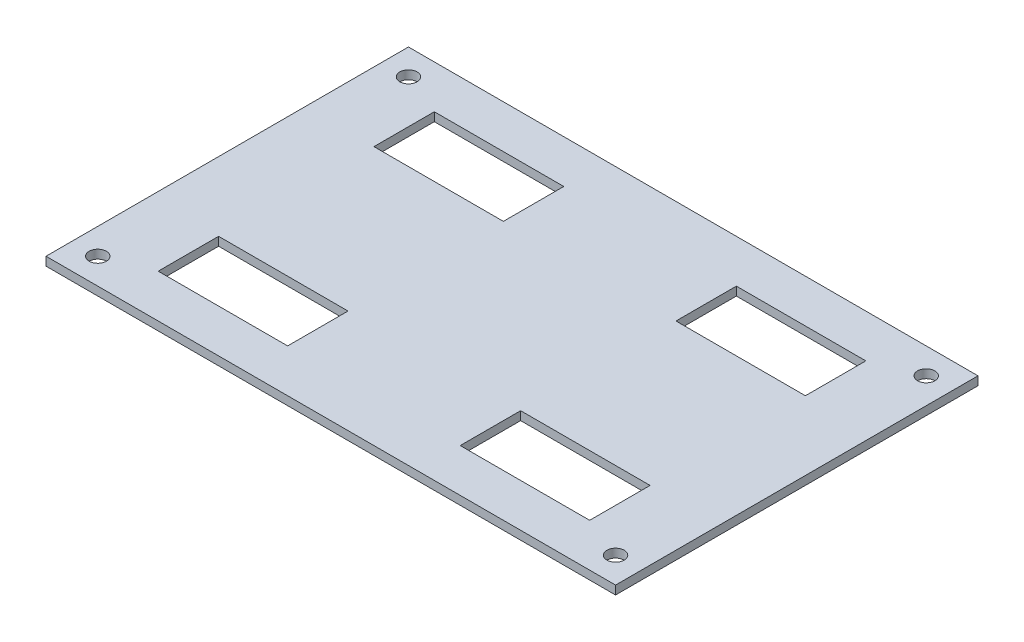
ISO-10303-21;
HEADER;
FILE_DESCRIPTION(('STEP AP214'),'2;1');
FILE_NAME('part.step','',(''),(''),'','','');
FILE_SCHEMA(('AUTOMOTIVE_DESIGN { 1 0 10303 214 1 1 1 1 }'));
ENDSEC;
DATA;
#1=APPLICATION_CONTEXT('core data for automotive mechanical design processes');
#2=APPLICATION_PROTOCOL_DEFINITION('international standard','automotive_design',2000,#1);
#3=PRODUCT_CONTEXT('',#1,'mechanical');
#4=PRODUCT('Part','Part','',(#3));
#5=PRODUCT_RELATED_PRODUCT_CATEGORY('part','',(#4));
#6=PRODUCT_DEFINITION_FORMATION('','',#4);
#7=PRODUCT_DEFINITION_CONTEXT('part definition',#1,'design');
#8=PRODUCT_DEFINITION('design','',#6,#7);
#9=PRODUCT_DEFINITION_SHAPE('','',#8);
#10=(LENGTH_UNIT() NAMED_UNIT(*) SI_UNIT(.MILLI.,.METRE.));
#11=(NAMED_UNIT(*) PLANE_ANGLE_UNIT() SI_UNIT($,.RADIAN.));
#12=(NAMED_UNIT(*) SI_UNIT($,.STERADIAN.) SOLID_ANGLE_UNIT());
#13=UNCERTAINTY_MEASURE_WITH_UNIT(LENGTH_MEASURE(1.E-05),#10,'distance_accuracy_value','');
#14=(GEOMETRIC_REPRESENTATION_CONTEXT(3) GLOBAL_UNCERTAINTY_ASSIGNED_CONTEXT((#13)) GLOBAL_UNIT_ASSIGNED_CONTEXT((#10,
#11,#12)) REPRESENTATION_CONTEXT('',''));
#15=CARTESIAN_POINT('',(0.,0.,0.));
#16=DIRECTION('',(0.,0.,1.));
#17=DIRECTION('',(1.,0.,0.));
#18=AXIS2_PLACEMENT_3D('',#15,#16,#17);
#19=CARTESIAN_POINT('',(0.,1.,0.));
#20=DIRECTION('',(0.,-1.,0.));
#21=DIRECTION('',(0.,0.,-1.));
#22=AXIS2_PLACEMENT_3D('',#19,#20,#21);
#23=PLANE('',#22);
#24=DIRECTION('',(0.,0.,1.));
#25=VECTOR('',#24,1.);
#26=CARTESIAN_POINT('',(10.,1.,-16.));
#27=LINE('',#26,#25);
#28=CARTESIAN_POINT('',(10.,1.,-16.));
#29=VERTEX_POINT('',#28);
#30=CARTESIAN_POINT('',(10.,1.,-9.00000000000001));
#31=VERTEX_POINT('',#30);
#32=EDGE_CURVE('E209',#29,#31,#27,.T.);
#33=ORIENTED_EDGE('',*,*,#32,.F.);
#34=DIRECTION('',(-1.,0.,0.));
#35=VECTOR('',#34,1.);
#36=CARTESIAN_POINT('',(10.,1.,-16.));
#37=LINE('',#36,#35);
#38=CARTESIAN_POINT('',(25.,1.,-16.));
#39=VERTEX_POINT('',#38);
#40=EDGE_CURVE('E217',#39,#29,#37,.T.);
#41=ORIENTED_EDGE('',*,*,#40,.F.);
#42=DIRECTION('',(0.,0.,-1.));
#43=VECTOR('',#42,1.);
#44=CARTESIAN_POINT('',(25.,1.,-16.));
#45=LINE('',#44,#43);
#46=CARTESIAN_POINT('',(25.,1.,-9.00000000000001));
#47=VERTEX_POINT('',#46);
#48=EDGE_CURVE('E214',#47,#39,#45,.T.);
#49=ORIENTED_EDGE('',*,*,#48,.F.);
#50=DIRECTION('',(1.,0.,0.));
#51=VECTOR('',#50,1.);
#52=CARTESIAN_POINT('',(10.,1.,-9.00000000000001));
#53=LINE('',#52,#51);
#54=EDGE_CURVE('E211',#31,#47,#53,.T.);
#55=ORIENTED_EDGE('',*,*,#54,.F.);
#56=EDGE_LOOP('',(#33,#41,#49,#55));
#57=FACE_BOUND('',#56,.T.);
#58=DIRECTION('',(0.,0.,1.));
#59=VECTOR('',#58,1.);
#60=CARTESIAN_POINT('',(10.,1.,9.));
#61=LINE('',#60,#59);
#62=CARTESIAN_POINT('',(10.,1.,9.));
#63=VERTEX_POINT('',#62);
#64=CARTESIAN_POINT('',(10.,1.,16.));
#65=VERTEX_POINT('',#64);
#66=EDGE_CURVE('E271',#63,#65,#61,.T.);
#67=ORIENTED_EDGE('',*,*,#66,.F.);
#68=DIRECTION('',(-1.,0.,0.));
#69=VECTOR('',#68,1.);
#70=CARTESIAN_POINT('',(10.,1.,9.));
#71=LINE('',#70,#69);
#72=CARTESIAN_POINT('',(25.,1.,9.));
#73=VERTEX_POINT('',#72);
#74=EDGE_CURVE('E279',#73,#63,#71,.T.);
#75=ORIENTED_EDGE('',*,*,#74,.F.);
#76=DIRECTION('',(0.,0.,-1.));
#77=VECTOR('',#76,1.);
#78=CARTESIAN_POINT('',(25.,1.,9.));
#79=LINE('',#78,#77);
#80=CARTESIAN_POINT('',(25.,1.,16.));
#81=VERTEX_POINT('',#80);
#82=EDGE_CURVE('E276',#81,#73,#79,.T.);
#83=ORIENTED_EDGE('',*,*,#82,.F.);
#84=DIRECTION('',(1.,0.,0.));
#85=VECTOR('',#84,1.);
#86=CARTESIAN_POINT('',(10.,1.,16.));
#87=LINE('',#86,#85);
#88=EDGE_CURVE('E273',#65,#81,#87,.T.);
#89=ORIENTED_EDGE('',*,*,#88,.F.);
#90=EDGE_LOOP('',(#67,#75,#83,#89));
#91=FACE_BOUND('',#90,.T.);
#92=DIRECTION('',(0.,0.,1.));
#93=VECTOR('',#92,1.);
#94=CARTESIAN_POINT('',(-33.,1.,21.));
#95=LINE('',#94,#93);
#96=CARTESIAN_POINT('',(-33.,1.,-21.));
#97=VERTEX_POINT('',#96);
#98=CARTESIAN_POINT('',(-33.,1.,21.));
#99=VERTEX_POINT('',#98);
#100=EDGE_CURVE('E326',#97,#99,#95,.T.);
#101=ORIENTED_EDGE('',*,*,#100,.T.);
#102=DIRECTION('',(1.,0.,0.));
#103=VECTOR('',#102,1.);
#104=CARTESIAN_POINT('',(-33.,1.,21.));
#105=LINE('',#104,#103);
#106=CARTESIAN_POINT('',(33.,1.,21.));
#107=VERTEX_POINT('',#106);
#108=EDGE_CURVE('E329',#99,#107,#105,.T.);
#109=ORIENTED_EDGE('',*,*,#108,.T.);
#110=DIRECTION('',(0.,0.,-1.));
#111=VECTOR('',#110,1.);
#112=CARTESIAN_POINT('',(33.,1.,21.));
#113=LINE('',#112,#111);
#114=CARTESIAN_POINT('',(33.,1.,-21.));
#115=VERTEX_POINT('',#114);
#116=EDGE_CURVE('E332',#107,#115,#113,.T.);
#117=ORIENTED_EDGE('',*,*,#116,.T.);
#118=DIRECTION('',(-1.,0.,0.));
#119=VECTOR('',#118,1.);
#120=CARTESIAN_POINT('',(-33.,1.,-21.));
#121=LINE('',#120,#119);
#122=EDGE_CURVE('E334',#115,#97,#121,.T.);
#123=ORIENTED_EDGE('',*,*,#122,.T.);
#124=EDGE_LOOP('',(#101,#109,#117,#123));
#125=FACE_BOUND('',#124,.T.);
#126=CARTESIAN_POINT('',(-30.,1.,18.));
#127=DIRECTION('',(0.,1.,0.));
#128=DIRECTION('',(0.,0.,1.));
#129=AXIS2_PLACEMENT_3D('',#126,#127,#128);
#130=CIRCLE('',#129,1.);
#131=CARTESIAN_POINT('',(-30.,1.,19.));
#132=VERTEX_POINT('',#131);
#133=EDGE_CURVE('E320',#132,#132,#130,.T.);
#134=ORIENTED_EDGE('',*,*,#133,.F.);
#135=EDGE_LOOP('',(#134));
#136=FACE_BOUND('',#135,.T.);
#137=CARTESIAN_POINT('',(30.,1.,18.));
#138=DIRECTION('',(0.,1.,0.));
#139=DIRECTION('',(0.,0.,1.));
#140=AXIS2_PLACEMENT_3D('',#137,#138,#139);
#141=CIRCLE('',#140,0.999999999999998);
#142=CARTESIAN_POINT('',(30.,1.,19.));
#143=VERTEX_POINT('',#142);
#144=EDGE_CURVE('E314',#143,#143,#141,.T.);
#145=ORIENTED_EDGE('',*,*,#144,.F.);
#146=EDGE_LOOP('',(#145));
#147=FACE_BOUND('',#146,.T.);
#148=CARTESIAN_POINT('',(30.,1.,-18.));
#149=DIRECTION('',(0.,1.,0.));
#150=DIRECTION('',(0.,0.,1.));
#151=AXIS2_PLACEMENT_3D('',#148,#149,#150);
#152=CIRCLE('',#151,0.999999999999998);
#153=CARTESIAN_POINT('',(30.,1.,-17.));
#154=VERTEX_POINT('',#153);
#155=EDGE_CURVE('E308',#154,#154,#152,.T.);
#156=ORIENTED_EDGE('',*,*,#155,.F.);
#157=EDGE_LOOP('',(#156));
#158=FACE_BOUND('',#157,.T.);
#159=CARTESIAN_POINT('',(-30.,1.,-18.));
#160=DIRECTION('',(0.,1.,0.));
#161=DIRECTION('',(0.,0.,1.));
#162=AXIS2_PLACEMENT_3D('',#159,#160,#161);
#163=CIRCLE('',#162,1.);
#164=CARTESIAN_POINT('',(-30.,1.,-17.));
#165=VERTEX_POINT('',#164);
#166=EDGE_CURVE('E302',#165,#165,#163,.T.);
#167=ORIENTED_EDGE('',*,*,#166,.F.);
#168=EDGE_LOOP('',(#167));
#169=FACE_BOUND('',#168,.T.);
#170=DIRECTION('',(0.,0.,1.));
#171=VECTOR('',#170,1.);
#172=CARTESIAN_POINT('',(-25.,1.,16.));
#173=LINE('',#172,#171);
#174=CARTESIAN_POINT('',(-25.,1.,9.));
#175=VERTEX_POINT('',#174);
#176=CARTESIAN_POINT('',(-25.,1.,16.));
#177=VERTEX_POINT('',#176);
#178=EDGE_CURVE('E240',#175,#177,#173,.T.);
#179=ORIENTED_EDGE('',*,*,#178,.F.);
#180=DIRECTION('',(-1.,0.,0.));
#181=VECTOR('',#180,1.);
#182=CARTESIAN_POINT('',(-25.,1.,9.));
#183=LINE('',#182,#181);
#184=CARTESIAN_POINT('',(-10.,1.,9.));
#185=VERTEX_POINT('',#184);
#186=EDGE_CURVE('E248',#185,#175,#183,.T.);
#187=ORIENTED_EDGE('',*,*,#186,.F.);
#188=DIRECTION('',(0.,0.,-1.));
#189=VECTOR('',#188,1.);
#190=CARTESIAN_POINT('',(-10.,1.,16.));
#191=LINE('',#190,#189);
#192=CARTESIAN_POINT('',(-10.,1.,16.));
#193=VERTEX_POINT('',#192);
#194=EDGE_CURVE('E245',#193,#185,#191,.T.);
#195=ORIENTED_EDGE('',*,*,#194,.F.);
#196=DIRECTION('',(1.,0.,0.));
#197=VECTOR('',#196,1.);
#198=CARTESIAN_POINT('',(-25.,1.,16.));
#199=LINE('',#198,#197);
#200=EDGE_CURVE('E242',#177,#193,#199,.T.);
#201=ORIENTED_EDGE('',*,*,#200,.F.);
#202=EDGE_LOOP('',(#179,#187,#195,#201));
#203=FACE_BOUND('',#202,.T.);
#204=DIRECTION('',(0.,0.,-1.));
#205=VECTOR('',#204,1.);
#206=CARTESIAN_POINT('',(-10.,1.,-9.00000000000001));
#207=LINE('',#206,#205);
#208=CARTESIAN_POINT('',(-10.,1.,-9.00000000000001));
#209=VERTEX_POINT('',#208);
#210=CARTESIAN_POINT('',(-10.,1.,-16.));
#211=VERTEX_POINT('',#210);
#212=EDGE_CURVE('E173',#209,#211,#207,.T.);
#213=ORIENTED_EDGE('',*,*,#212,.F.);
#214=DIRECTION('',(1.,0.,0.));
#215=VECTOR('',#214,1.);
#216=CARTESIAN_POINT('',(-10.,1.,-9.00000000000001));
#217=LINE('',#216,#215);
#218=CARTESIAN_POINT('',(-25.,1.,-9.));
#219=VERTEX_POINT('',#218);
#220=EDGE_CURVE('E195',#219,#209,#217,.T.);
#221=ORIENTED_EDGE('',*,*,#220,.F.);
#222=DIRECTION('',(0.,0.,1.));
#223=VECTOR('',#222,1.);
#224=CARTESIAN_POINT('',(-25.,1.,-9.));
#225=LINE('',#224,#223);
#226=CARTESIAN_POINT('',(-25.,1.,-16.));
#227=VERTEX_POINT('',#226);
#228=EDGE_CURVE('E193',#227,#219,#225,.T.);
#229=ORIENTED_EDGE('',*,*,#228,.F.);
#230=DIRECTION('',(-1.,0.,0.));
#231=VECTOR('',#230,1.);
#232=CARTESIAN_POINT('',(-10.,1.,-16.));
#233=LINE('',#232,#231);
#234=EDGE_CURVE('E181',#211,#227,#233,.T.);
#235=ORIENTED_EDGE('',*,*,#234,.F.);
#236=EDGE_LOOP('',(#213,#221,#229,#235));
#237=FACE_BOUND('',#236,.T.);
#238=ADVANCED_FACE('F36',(#57,#91,#125,#136,#147,#158,#169,#203,#237),#23,.F.);
#239=CARTESIAN_POINT('',(0.,0.,0.));
#240=DIRECTION('',(0.,-1.,0.));
#241=DIRECTION('',(0.,0.,-1.));
#242=AXIS2_PLACEMENT_3D('',#239,#240,#241);
#243=PLANE('',#242);
#244=CARTESIAN_POINT('',(30.,0.,-18.));
#245=DIRECTION('',(0.,1.,0.));
#246=DIRECTION('',(0.,0.,1.));
#247=AXIS2_PLACEMENT_3D('',#244,#245,#246);
#248=CIRCLE('',#247,0.999999999999998);
#249=CARTESIAN_POINT('',(30.,0.,-17.));
#250=VERTEX_POINT('',#249);
#251=EDGE_CURVE('E305',#250,#250,#248,.T.);
#252=ORIENTED_EDGE('',*,*,#251,.T.);
#253=EDGE_LOOP('',(#252));
#254=FACE_BOUND('',#253,.T.);
#255=CARTESIAN_POINT('',(-30.,0.,18.));
#256=DIRECTION('',(0.,1.,0.));
#257=DIRECTION('',(0.,0.,1.));
#258=AXIS2_PLACEMENT_3D('',#255,#256,#257);
#259=CIRCLE('',#258,1.);
#260=CARTESIAN_POINT('',(-30.,0.,19.));
#261=VERTEX_POINT('',#260);
#262=EDGE_CURVE('E317',#261,#261,#259,.T.);
#263=ORIENTED_EDGE('',*,*,#262,.T.);
#264=EDGE_LOOP('',(#263));
#265=FACE_BOUND('',#264,.T.);
#266=DIRECTION('',(0.,0.,1.));
#267=VECTOR('',#266,1.);
#268=CARTESIAN_POINT('',(-33.,0.,21.));
#269=LINE('',#268,#267);
#270=CARTESIAN_POINT('',(-33.,0.,-21.));
#271=VERTEX_POINT('',#270);
#272=CARTESIAN_POINT('',(-33.,0.,21.));
#273=VERTEX_POINT('',#272);
#274=EDGE_CURVE('E323',#271,#273,#269,.T.);
#275=ORIENTED_EDGE('',*,*,#274,.F.);
#276=DIRECTION('',(-1.,0.,0.));
#277=VECTOR('',#276,1.);
#278=CARTESIAN_POINT('',(-33.,0.,-21.));
#279=LINE('',#278,#277);
#280=CARTESIAN_POINT('',(33.,0.,-21.));
#281=VERTEX_POINT('',#280);
#282=EDGE_CURVE('E330',#281,#271,#279,.T.);
#283=ORIENTED_EDGE('',*,*,#282,.F.);
#284=DIRECTION('',(0.,0.,-1.));
#285=VECTOR('',#284,1.);
#286=CARTESIAN_POINT('',(33.,0.,21.));
#287=LINE('',#286,#285);
#288=CARTESIAN_POINT('',(33.,0.,21.));
#289=VERTEX_POINT('',#288);
#290=EDGE_CURVE('E341',#289,#281,#287,.T.);
#291=ORIENTED_EDGE('',*,*,#290,.F.);
#292=DIRECTION('',(1.,0.,0.));
#293=VECTOR('',#292,1.);
#294=CARTESIAN_POINT('',(-33.,0.,21.));
#295=LINE('',#294,#293);
#296=EDGE_CURVE('E339',#273,#289,#295,.T.);
#297=ORIENTED_EDGE('',*,*,#296,.F.);
#298=EDGE_LOOP('',(#275,#283,#291,#297));
#299=FACE_BOUND('',#298,.T.);
#300=CARTESIAN_POINT('',(30.,0.,18.));
#301=DIRECTION('',(0.,1.,0.));
#302=DIRECTION('',(0.,0.,1.));
#303=AXIS2_PLACEMENT_3D('',#300,#301,#302);
#304=CIRCLE('',#303,0.999999999999998);
#305=CARTESIAN_POINT('',(30.,0.,19.));
#306=VERTEX_POINT('',#305);
#307=EDGE_CURVE('E311',#306,#306,#304,.T.);
#308=ORIENTED_EDGE('',*,*,#307,.T.);
#309=EDGE_LOOP('',(#308));
#310=FACE_BOUND('',#309,.T.);
#311=CARTESIAN_POINT('',(-30.,0.,-18.));
#312=DIRECTION('',(0.,1.,0.));
#313=DIRECTION('',(0.,0.,1.));
#314=AXIS2_PLACEMENT_3D('',#311,#312,#313);
#315=CIRCLE('',#314,1.);
#316=CARTESIAN_POINT('',(-30.,0.,-17.));
#317=VERTEX_POINT('',#316);
#318=EDGE_CURVE('E301',#317,#317,#315,.T.);
#319=ORIENTED_EDGE('',*,*,#318,.T.);
#320=EDGE_LOOP('',(#319));
#321=FACE_BOUND('',#320,.T.);
#322=DIRECTION('',(-1.,0.,0.));
#323=VECTOR('',#322,1.);
#324=CARTESIAN_POINT('',(10.,0.,9.));
#325=LINE('',#324,#323);
#326=CARTESIAN_POINT('',(25.,0.,9.));
#327=VERTEX_POINT('',#326);
#328=CARTESIAN_POINT('',(10.,0.,9.));
#329=VERTEX_POINT('',#328);
#330=EDGE_CURVE('E274',#327,#329,#325,.T.);
#331=ORIENTED_EDGE('',*,*,#330,.T.);
#332=DIRECTION('',(0.,0.,1.));
#333=VECTOR('',#332,1.);
#334=CARTESIAN_POINT('',(10.,0.,9.));
#335=LINE('',#334,#333);
#336=CARTESIAN_POINT('',(10.,0.,16.));
#337=VERTEX_POINT('',#336);
#338=EDGE_CURVE('E270',#329,#337,#335,.T.);
#339=ORIENTED_EDGE('',*,*,#338,.T.);
#340=DIRECTION('',(1.,0.,0.));
#341=VECTOR('',#340,1.);
#342=CARTESIAN_POINT('',(10.,0.,16.));
#343=LINE('',#342,#341);
#344=CARTESIAN_POINT('',(25.,0.,16.));
#345=VERTEX_POINT('',#344);
#346=EDGE_CURVE('E284',#337,#345,#343,.T.);
#347=ORIENTED_EDGE('',*,*,#346,.T.);
#348=DIRECTION('',(0.,0.,-1.));
#349=VECTOR('',#348,1.);
#350=CARTESIAN_POINT('',(25.,0.,9.));
#351=LINE('',#350,#349);
#352=EDGE_CURVE('E287',#345,#327,#351,.T.);
#353=ORIENTED_EDGE('',*,*,#352,.T.);
#354=EDGE_LOOP('',(#331,#339,#347,#353));
#355=FACE_BOUND('',#354,.T.);
#356=DIRECTION('',(-1.,0.,0.));
#357=VECTOR('',#356,1.);
#358=CARTESIAN_POINT('',(-25.,0.,9.));
#359=LINE('',#358,#357);
#360=CARTESIAN_POINT('',(-10.,0.,9.));
#361=VERTEX_POINT('',#360);
#362=CARTESIAN_POINT('',(-25.,0.,9.));
#363=VERTEX_POINT('',#362);
#364=EDGE_CURVE('E243',#361,#363,#359,.T.);
#365=ORIENTED_EDGE('',*,*,#364,.T.);
#366=DIRECTION('',(0.,0.,1.));
#367=VECTOR('',#366,1.);
#368=CARTESIAN_POINT('',(-25.,0.,16.));
#369=LINE('',#368,#367);
#370=CARTESIAN_POINT('',(-25.,0.,16.));
#371=VERTEX_POINT('',#370);
#372=EDGE_CURVE('E239',#363,#371,#369,.T.);
#373=ORIENTED_EDGE('',*,*,#372,.T.);
#374=DIRECTION('',(1.,0.,0.));
#375=VECTOR('',#374,1.);
#376=CARTESIAN_POINT('',(-25.,0.,16.));
#377=LINE('',#376,#375);
#378=CARTESIAN_POINT('',(-10.,0.,16.));
#379=VERTEX_POINT('',#378);
#380=EDGE_CURVE('E253',#371,#379,#377,.T.);
#381=ORIENTED_EDGE('',*,*,#380,.T.);
#382=DIRECTION('',(0.,0.,-1.));
#383=VECTOR('',#382,1.);
#384=CARTESIAN_POINT('',(-10.,0.,16.));
#385=LINE('',#384,#383);
#386=EDGE_CURVE('E256',#379,#361,#385,.T.);
#387=ORIENTED_EDGE('',*,*,#386,.T.);
#388=EDGE_LOOP('',(#365,#373,#381,#387));
#389=FACE_BOUND('',#388,.T.);
#390=DIRECTION('',(-1.,0.,0.));
#391=VECTOR('',#390,1.);
#392=CARTESIAN_POINT('',(10.,0.,-16.));
#393=LINE('',#392,#391);
#394=CARTESIAN_POINT('',(25.,0.,-16.));
#395=VERTEX_POINT('',#394);
#396=CARTESIAN_POINT('',(10.,0.,-16.));
#397=VERTEX_POINT('',#396);
#398=EDGE_CURVE('E212',#395,#397,#393,.T.);
#399=ORIENTED_EDGE('',*,*,#398,.T.);
#400=DIRECTION('',(0.,0.,1.));
#401=VECTOR('',#400,1.);
#402=CARTESIAN_POINT('',(10.,0.,-16.));
#403=LINE('',#402,#401);
#404=CARTESIAN_POINT('',(10.,0.,-9.00000000000001));
#405=VERTEX_POINT('',#404);
#406=EDGE_CURVE('E189',#397,#405,#403,.T.);
#407=ORIENTED_EDGE('',*,*,#406,.T.);
#408=DIRECTION('',(1.,0.,0.));
#409=VECTOR('',#408,1.);
#410=CARTESIAN_POINT('',(10.,0.,-9.00000000000001));
#411=LINE('',#410,#409);
#412=CARTESIAN_POINT('',(25.,0.,-9.00000000000001));
#413=VERTEX_POINT('',#412);
#414=EDGE_CURVE('E222',#405,#413,#411,.T.);
#415=ORIENTED_EDGE('',*,*,#414,.T.);
#416=DIRECTION('',(0.,0.,-1.));
#417=VECTOR('',#416,1.);
#418=CARTESIAN_POINT('',(25.,0.,-16.));
#419=LINE('',#418,#417);
#420=EDGE_CURVE('E225',#413,#395,#419,.T.);
#421=ORIENTED_EDGE('',*,*,#420,.T.);
#422=EDGE_LOOP('',(#399,#407,#415,#421));
#423=FACE_BOUND('',#422,.T.);
#424=DIRECTION('',(1.,0.,0.));
#425=VECTOR('',#424,1.);
#426=CARTESIAN_POINT('',(-10.,0.,-9.00000000000001));
#427=LINE('',#426,#425);
#428=CARTESIAN_POINT('',(-25.,0.,-9.));
#429=VERTEX_POINT('',#428);
#430=CARTESIAN_POINT('',(-10.,0.,-9.00000000000001));
#431=VERTEX_POINT('',#430);
#432=EDGE_CURVE('E182',#429,#431,#427,.T.);
#433=ORIENTED_EDGE('',*,*,#432,.T.);
#434=DIRECTION('',(0.,0.,-1.));
#435=VECTOR('',#434,1.);
#436=CARTESIAN_POINT('',(-10.,0.,-9.00000000000001));
#437=LINE('',#436,#435);
#438=CARTESIAN_POINT('',(-10.,0.,-16.));
#439=VERTEX_POINT('',#438);
#440=EDGE_CURVE('E59',#431,#439,#437,.T.);
#441=ORIENTED_EDGE('',*,*,#440,.T.);
#442=DIRECTION('',(-1.,0.,0.));
#443=VECTOR('',#442,1.);
#444=CARTESIAN_POINT('',(-10.,0.,-16.));
#445=LINE('',#444,#443);
#446=CARTESIAN_POINT('',(-25.,0.,-16.));
#447=VERTEX_POINT('',#446);
#448=EDGE_CURVE('E188',#439,#447,#445,.T.);
#449=ORIENTED_EDGE('',*,*,#448,.T.);
#450=DIRECTION('',(0.,0.,1.));
#451=VECTOR('',#450,1.);
#452=CARTESIAN_POINT('',(-25.,0.,-9.));
#453=LINE('',#452,#451);
#454=EDGE_CURVE('E201',#447,#429,#453,.T.);
#455=ORIENTED_EDGE('',*,*,#454,.T.);
#456=EDGE_LOOP('',(#433,#441,#449,#455));
#457=FACE_BOUND('',#456,.T.);
#458=ADVANCED_FACE('F359',(#254,#265,#299,#310,#321,#355,#389,#423,#457),#243,.T.);
#459=CARTESIAN_POINT('',(-33.,1.,21.));
#460=DIRECTION('',(1.,0.,0.));
#461=DIRECTION('',(0.,0.,-1.));
#462=AXIS2_PLACEMENT_3D('',#459,#460,#461);
#463=PLANE('',#462);
#464=ORIENTED_EDGE('',*,*,#274,.T.);
#465=DIRECTION('',(0.,-1.,0.));
#466=VECTOR('',#465,1.);
#467=CARTESIAN_POINT('',(-33.,1.,21.));
#468=LINE('',#467,#466);
#469=EDGE_CURVE('E11',#99,#273,#468,.T.);
#470=ORIENTED_EDGE('',*,*,#469,.F.);
#471=ORIENTED_EDGE('',*,*,#100,.F.);
#472=DIRECTION('',(0.,-1.,0.));
#473=VECTOR('',#472,1.);
#474=CARTESIAN_POINT('',(-33.,1.,-21.));
#475=LINE('',#474,#473);
#476=EDGE_CURVE('E336',#97,#271,#475,.T.);
#477=ORIENTED_EDGE('',*,*,#476,.T.);
#478=EDGE_LOOP('',(#464,#470,#471,#477));
#479=FACE_BOUND('',#478,.T.);
#480=ADVANCED_FACE('F38',(#479),#463,.F.);
#481=CARTESIAN_POINT('',(-33.,1.,21.));
#482=DIRECTION('',(0.,0.,-1.));
#483=DIRECTION('',(-1.,0.,0.));
#484=AXIS2_PLACEMENT_3D('',#481,#482,#483);
#485=PLANE('',#484);
#486=ORIENTED_EDGE('',*,*,#296,.T.);
#487=DIRECTION('',(0.,-1.,0.));
#488=VECTOR('',#487,1.);
#489=CARTESIAN_POINT('',(33.,1.,21.));
#490=LINE('',#489,#488);
#491=EDGE_CURVE('E44',#107,#289,#490,.T.);
#492=ORIENTED_EDGE('',*,*,#491,.F.);
#493=ORIENTED_EDGE('',*,*,#108,.F.);
#494=ORIENTED_EDGE('',*,*,#469,.T.);
#495=EDGE_LOOP('',(#486,#492,#493,#494));
#496=FACE_BOUND('',#495,.T.);
#497=ADVANCED_FACE('F370',(#496),#485,.F.);
#498=CARTESIAN_POINT('',(33.,1.,21.));
#499=DIRECTION('',(-1.,0.,0.));
#500=DIRECTION('',(0.,0.,1.));
#501=AXIS2_PLACEMENT_3D('',#498,#499,#500);
#502=PLANE('',#501);
#503=ORIENTED_EDGE('',*,*,#290,.T.);
#504=DIRECTION('',(0.,-1.,0.));
#505=VECTOR('',#504,1.);
#506=CARTESIAN_POINT('',(33.,1.,-21.));
#507=LINE('',#506,#505);
#508=EDGE_CURVE('E346',#115,#281,#507,.T.);
#509=ORIENTED_EDGE('',*,*,#508,.F.);
#510=ORIENTED_EDGE('',*,*,#116,.F.);
#511=ORIENTED_EDGE('',*,*,#491,.T.);
#512=EDGE_LOOP('',(#503,#509,#510,#511));
#513=FACE_BOUND('',#512,.T.);
#514=ADVANCED_FACE('F353',(#513),#502,.F.);
#515=CARTESIAN_POINT('',(-33.,1.,-21.));
#516=DIRECTION('',(0.,0.,1.));
#517=DIRECTION('',(1.,0.,0.));
#518=AXIS2_PLACEMENT_3D('',#515,#516,#517);
#519=PLANE('',#518);
#520=ORIENTED_EDGE('',*,*,#282,.T.);
#521=ORIENTED_EDGE('',*,*,#476,.F.);
#522=ORIENTED_EDGE('',*,*,#122,.F.);
#523=ORIENTED_EDGE('',*,*,#508,.T.);
#524=EDGE_LOOP('',(#520,#521,#522,#523));
#525=FACE_BOUND('',#524,.T.);
#526=ADVANCED_FACE('F363',(#525),#519,.F.);
#527=CARTESIAN_POINT('',(-30.,1.,18.));
#528=DIRECTION('',(0.,-1.,0.));
#529=DIRECTION('',(0.,0.,-1.));
#530=AXIS2_PLACEMENT_3D('',#527,#528,#529);
#531=CYLINDRICAL_SURFACE('',#530,1.);
#532=ORIENTED_EDGE('',*,*,#133,.T.);
#533=EDGE_LOOP('',(#532));
#534=FACE_BOUND('',#533,.T.);
#535=ORIENTED_EDGE('',*,*,#262,.F.);
#536=EDGE_LOOP('',(#535));
#537=FACE_BOUND('',#536,.T.);
#538=ADVANCED_FACE('F388',(#534,#537),#531,.F.);
#539=CARTESIAN_POINT('',(30.,1.,18.));
#540=DIRECTION('',(0.,-1.,0.));
#541=DIRECTION('',(0.,0.,-1.));
#542=AXIS2_PLACEMENT_3D('',#539,#540,#541);
#543=CYLINDRICAL_SURFACE('',#542,0.999999999999998);
#544=ORIENTED_EDGE('',*,*,#144,.T.);
#545=EDGE_LOOP('',(#544));
#546=FACE_BOUND('',#545,.T.);
#547=ORIENTED_EDGE('',*,*,#307,.F.);
#548=EDGE_LOOP('',(#547));
#549=FACE_BOUND('',#548,.T.);
#550=ADVANCED_FACE('F395',(#546,#549),#543,.F.);
#551=CARTESIAN_POINT('',(30.,1.,-18.));
#552=DIRECTION('',(0.,-1.,0.));
#553=DIRECTION('',(0.,0.,-1.));
#554=AXIS2_PLACEMENT_3D('',#551,#552,#553);
#555=CYLINDRICAL_SURFACE('',#554,0.999999999999998);
#556=ORIENTED_EDGE('',*,*,#155,.T.);
#557=EDGE_LOOP('',(#556));
#558=FACE_BOUND('',#557,.T.);
#559=ORIENTED_EDGE('',*,*,#251,.F.);
#560=EDGE_LOOP('',(#559));
#561=FACE_BOUND('',#560,.T.);
#562=ADVANCED_FACE('F400',(#558,#561),#555,.F.);
#563=CARTESIAN_POINT('',(-30.,1.,-18.));
#564=DIRECTION('',(0.,-1.,0.));
#565=DIRECTION('',(0.,0.,-1.));
#566=AXIS2_PLACEMENT_3D('',#563,#564,#565);
#567=CYLINDRICAL_SURFACE('',#566,1.);
#568=ORIENTED_EDGE('',*,*,#166,.T.);
#569=EDGE_LOOP('',(#568));
#570=FACE_BOUND('',#569,.T.);
#571=ORIENTED_EDGE('',*,*,#318,.F.);
#572=EDGE_LOOP('',(#571));
#573=FACE_BOUND('',#572,.T.);
#574=ADVANCED_FACE('F460',(#570,#573),#567,.F.);
#575=CARTESIAN_POINT('',(10.,1.,9.));
#576=DIRECTION('',(1.,0.,0.));
#577=DIRECTION('',(0.,0.,-1.));
#578=AXIS2_PLACEMENT_3D('',#575,#576,#577);
#579=PLANE('',#578);
#580=ORIENTED_EDGE('',*,*,#338,.F.);
#581=DIRECTION('',(0.,-1.,0.));
#582=VECTOR('',#581,1.);
#583=CARTESIAN_POINT('',(10.,1.,9.));
#584=LINE('',#583,#582);
#585=EDGE_CURVE('E281',#63,#329,#584,.T.);
#586=ORIENTED_EDGE('',*,*,#585,.F.);
#587=ORIENTED_EDGE('',*,*,#66,.T.);
#588=DIRECTION('',(0.,-1.,0.));
#589=VECTOR('',#588,1.);
#590=CARTESIAN_POINT('',(10.,1.,16.));
#591=LINE('',#590,#589);
#592=EDGE_CURVE('E298',#65,#337,#591,.T.);
#593=ORIENTED_EDGE('',*,*,#592,.T.);
#594=EDGE_LOOP('',(#580,#586,#587,#593));
#595=FACE_BOUND('',#594,.T.);
#596=ADVANCED_FACE('F456',(#595),#579,.T.);
#597=CARTESIAN_POINT('',(10.,1.,16.));
#598=DIRECTION('',(0.,0.,-1.));
#599=DIRECTION('',(-1.,0.,0.));
#600=AXIS2_PLACEMENT_3D('',#597,#598,#599);
#601=PLANE('',#600);
#602=ORIENTED_EDGE('',*,*,#346,.F.);
#603=ORIENTED_EDGE('',*,*,#592,.F.);
#604=ORIENTED_EDGE('',*,*,#88,.T.);
#605=DIRECTION('',(0.,-1.,0.));
#606=VECTOR('',#605,1.);
#607=CARTESIAN_POINT('',(25.,1.,16.));
#608=LINE('',#607,#606);
#609=EDGE_CURVE('E296',#81,#345,#608,.T.);
#610=ORIENTED_EDGE('',*,*,#609,.T.);
#611=EDGE_LOOP('',(#602,#603,#604,#610));
#612=FACE_BOUND('',#611,.T.);
#613=ADVANCED_FACE('F452',(#612),#601,.T.);
#614=CARTESIAN_POINT('',(25.,1.,9.));
#615=DIRECTION('',(-1.,0.,0.));
#616=DIRECTION('',(0.,0.,1.));
#617=AXIS2_PLACEMENT_3D('',#614,#615,#616);
#618=PLANE('',#617);
#619=ORIENTED_EDGE('',*,*,#352,.F.);
#620=ORIENTED_EDGE('',*,*,#609,.F.);
#621=ORIENTED_EDGE('',*,*,#82,.T.);
#622=DIRECTION('',(0.,-1.,0.));
#623=VECTOR('',#622,1.);
#624=CARTESIAN_POINT('',(25.,1.,9.));
#625=LINE('',#624,#623);
#626=EDGE_CURVE('E294',#73,#327,#625,.T.);
#627=ORIENTED_EDGE('',*,*,#626,.T.);
#628=EDGE_LOOP('',(#619,#620,#621,#627));
#629=FACE_BOUND('',#628,.T.);
#630=ADVANCED_FACE('F448',(#629),#618,.T.);
#631=CARTESIAN_POINT('',(10.,1.,9.));
#632=DIRECTION('',(0.,0.,1.));
#633=DIRECTION('',(1.,0.,0.));
#634=AXIS2_PLACEMENT_3D('',#631,#632,#633);
#635=PLANE('',#634);
#636=ORIENTED_EDGE('',*,*,#330,.F.);
#637=ORIENTED_EDGE('',*,*,#626,.F.);
#638=ORIENTED_EDGE('',*,*,#74,.T.);
#639=ORIENTED_EDGE('',*,*,#585,.T.);
#640=EDGE_LOOP('',(#636,#637,#638,#639));
#641=FACE_BOUND('',#640,.T.);
#642=ADVANCED_FACE('F445',(#641),#635,.T.);
#643=CARTESIAN_POINT('',(-25.,1.,16.));
#644=DIRECTION('',(1.,0.,0.));
#645=DIRECTION('',(0.,0.,-1.));
#646=AXIS2_PLACEMENT_3D('',#643,#644,#645);
#647=PLANE('',#646);
#648=ORIENTED_EDGE('',*,*,#372,.F.);
#649=DIRECTION('',(0.,-1.,0.));
#650=VECTOR('',#649,1.);
#651=CARTESIAN_POINT('',(-25.,1.,9.));
#652=LINE('',#651,#650);
#653=EDGE_CURVE('E250',#175,#363,#652,.T.);
#654=ORIENTED_EDGE('',*,*,#653,.F.);
#655=ORIENTED_EDGE('',*,*,#178,.T.);
#656=DIRECTION('',(0.,-1.,0.));
#657=VECTOR('',#656,1.);
#658=CARTESIAN_POINT('',(-25.,1.,16.));
#659=LINE('',#658,#657);
#660=EDGE_CURVE('E267',#177,#371,#659,.T.);
#661=ORIENTED_EDGE('',*,*,#660,.T.);
#662=EDGE_LOOP('',(#648,#654,#655,#661));
#663=FACE_BOUND('',#662,.T.);
#664=ADVANCED_FACE('F420',(#663),#647,.T.);
#665=CARTESIAN_POINT('',(-25.,1.,16.));
#666=DIRECTION('',(0.,0.,-1.));
#667=DIRECTION('',(-1.,0.,0.));
#668=AXIS2_PLACEMENT_3D('',#665,#666,#667);
#669=PLANE('',#668);
#670=ORIENTED_EDGE('',*,*,#380,.F.);
#671=ORIENTED_EDGE('',*,*,#660,.F.);
#672=ORIENTED_EDGE('',*,*,#200,.T.);
#673=DIRECTION('',(0.,-1.,0.));
#674=VECTOR('',#673,1.);
#675=CARTESIAN_POINT('',(-10.,1.,16.));
#676=LINE('',#675,#674);
#677=EDGE_CURVE('E265',#193,#379,#676,.T.);
#678=ORIENTED_EDGE('',*,*,#677,.T.);
#679=EDGE_LOOP('',(#670,#671,#672,#678));
#680=FACE_BOUND('',#679,.T.);
#681=ADVANCED_FACE('F422',(#680),#669,.T.);
#682=CARTESIAN_POINT('',(-10.,1.,16.));
#683=DIRECTION('',(-1.,0.,0.));
#684=DIRECTION('',(0.,0.,1.));
#685=AXIS2_PLACEMENT_3D('',#682,#683,#684);
#686=PLANE('',#685);
#687=ORIENTED_EDGE('',*,*,#386,.F.);
#688=ORIENTED_EDGE('',*,*,#677,.F.);
#689=ORIENTED_EDGE('',*,*,#194,.T.);
#690=DIRECTION('',(0.,-1.,0.));
#691=VECTOR('',#690,1.);
#692=CARTESIAN_POINT('',(-10.,1.,9.));
#693=LINE('',#692,#691);
#694=EDGE_CURVE('E263',#185,#361,#693,.T.);
#695=ORIENTED_EDGE('',*,*,#694,.T.);
#696=EDGE_LOOP('',(#687,#688,#689,#695));
#697=FACE_BOUND('',#696,.T.);
#698=ADVANCED_FACE('F431',(#697),#686,.T.);
#699=CARTESIAN_POINT('',(-25.,1.,9.));
#700=DIRECTION('',(0.,0.,1.));
#701=DIRECTION('',(1.,0.,0.));
#702=AXIS2_PLACEMENT_3D('',#699,#700,#701);
#703=PLANE('',#702);
#704=ORIENTED_EDGE('',*,*,#364,.F.);
#705=ORIENTED_EDGE('',*,*,#694,.F.);
#706=ORIENTED_EDGE('',*,*,#186,.T.);
#707=ORIENTED_EDGE('',*,*,#653,.T.);
#708=EDGE_LOOP('',(#704,#705,#706,#707));
#709=FACE_BOUND('',#708,.T.);
#710=ADVANCED_FACE('F429',(#709),#703,.T.);
#711=CARTESIAN_POINT('',(10.,1.,-16.));
#712=DIRECTION('',(1.,0.,0.));
#713=DIRECTION('',(0.,0.,-1.));
#714=AXIS2_PLACEMENT_3D('',#711,#712,#713);
#715=PLANE('',#714);
#716=ORIENTED_EDGE('',*,*,#406,.F.);
#717=DIRECTION('',(0.,-1.,0.));
#718=VECTOR('',#717,1.);
#719=CARTESIAN_POINT('',(10.,1.,-16.));
#720=LINE('',#719,#718);
#721=EDGE_CURVE('E219',#29,#397,#720,.T.);
#722=ORIENTED_EDGE('',*,*,#721,.F.);
#723=ORIENTED_EDGE('',*,*,#32,.T.);
#724=DIRECTION('',(0.,-1.,0.));
#725=VECTOR('',#724,1.);
#726=CARTESIAN_POINT('',(10.,1.,-9.00000000000001));
#727=LINE('',#726,#725);
#728=EDGE_CURVE('E236',#31,#405,#727,.T.);
#729=ORIENTED_EDGE('',*,*,#728,.T.);
#730=EDGE_LOOP('',(#716,#722,#723,#729));
#731=FACE_BOUND('',#730,.T.);
#732=ADVANCED_FACE('F438',(#731),#715,.T.);
#733=CARTESIAN_POINT('',(10.,1.,-9.00000000000001));
#734=DIRECTION('',(0.,0.,-1.));
#735=DIRECTION('',(-1.,0.,0.));
#736=AXIS2_PLACEMENT_3D('',#733,#734,#735);
#737=PLANE('',#736);
#738=ORIENTED_EDGE('',*,*,#414,.F.);
#739=ORIENTED_EDGE('',*,*,#728,.F.);
#740=ORIENTED_EDGE('',*,*,#54,.T.);
#741=DIRECTION('',(0.,-1.,0.));
#742=VECTOR('',#741,1.);
#743=CARTESIAN_POINT('',(25.,1.,-9.00000000000001));
#744=LINE('',#743,#742);
#745=EDGE_CURVE('E234',#47,#413,#744,.T.);
#746=ORIENTED_EDGE('',*,*,#745,.T.);
#747=EDGE_LOOP('',(#738,#739,#740,#746));
#748=FACE_BOUND('',#747,.T.);
#749=ADVANCED_FACE('F520',(#748),#737,.T.);
#750=CARTESIAN_POINT('',(25.,1.,-16.));
#751=DIRECTION('',(-1.,0.,0.));
#752=DIRECTION('',(0.,0.,1.));
#753=AXIS2_PLACEMENT_3D('',#750,#751,#752);
#754=PLANE('',#753);
#755=ORIENTED_EDGE('',*,*,#420,.F.);
#756=ORIENTED_EDGE('',*,*,#745,.F.);
#757=ORIENTED_EDGE('',*,*,#48,.T.);
#758=DIRECTION('',(0.,-1.,0.));
#759=VECTOR('',#758,1.);
#760=CARTESIAN_POINT('',(25.,1.,-16.));
#761=LINE('',#760,#759);
#762=EDGE_CURVE('E232',#39,#395,#761,.T.);
#763=ORIENTED_EDGE('',*,*,#762,.T.);
#764=EDGE_LOOP('',(#755,#756,#757,#763));
#765=FACE_BOUND('',#764,.T.);
#766=ADVANCED_FACE('F529',(#765),#754,.T.);
#767=CARTESIAN_POINT('',(10.,1.,-16.));
#768=DIRECTION('',(0.,0.,1.));
#769=DIRECTION('',(1.,0.,0.));
#770=AXIS2_PLACEMENT_3D('',#767,#768,#769);
#771=PLANE('',#770);
#772=ORIENTED_EDGE('',*,*,#398,.F.);
#773=ORIENTED_EDGE('',*,*,#762,.F.);
#774=ORIENTED_EDGE('',*,*,#40,.T.);
#775=ORIENTED_EDGE('',*,*,#721,.T.);
#776=EDGE_LOOP('',(#772,#773,#774,#775));
#777=FACE_BOUND('',#776,.T.);
#778=ADVANCED_FACE('F539',(#777),#771,.T.);
#779=CARTESIAN_POINT('',(-10.,1.,-9.00000000000001));
#780=DIRECTION('',(-1.,0.,0.));
#781=DIRECTION('',(0.,0.,1.));
#782=AXIS2_PLACEMENT_3D('',#779,#780,#781);
#783=PLANE('',#782);
#784=ORIENTED_EDGE('',*,*,#440,.F.);
#785=DIRECTION('',(0.,-1.,0.));
#786=VECTOR('',#785,1.);
#787=CARTESIAN_POINT('',(-10.,1.,-9.00000000000001));
#788=LINE('',#787,#786);
#789=EDGE_CURVE('E177',#209,#431,#788,.T.);
#790=ORIENTED_EDGE('',*,*,#789,.F.);
#791=ORIENTED_EDGE('',*,*,#212,.T.);
#792=DIRECTION('',(0.,-1.,0.));
#793=VECTOR('',#792,1.);
#794=CARTESIAN_POINT('',(-10.,1.,-16.));
#795=LINE('',#794,#793);
#796=EDGE_CURVE('E176',#211,#439,#795,.T.);
#797=ORIENTED_EDGE('',*,*,#796,.T.);
#798=EDGE_LOOP('',(#784,#790,#791,#797));
#799=FACE_BOUND('',#798,.T.);
#800=ADVANCED_FACE('F175',(#799),#783,.T.);
#801=CARTESIAN_POINT('',(-10.,1.,-16.));
#802=DIRECTION('',(0.,0.,1.));
#803=DIRECTION('',(1.,0.,0.));
#804=AXIS2_PLACEMENT_3D('',#801,#802,#803);
#805=PLANE('',#804);
#806=ORIENTED_EDGE('',*,*,#448,.F.);
#807=ORIENTED_EDGE('',*,*,#796,.F.);
#808=ORIENTED_EDGE('',*,*,#234,.T.);
#809=DIRECTION('',(0.,-1.,0.));
#810=VECTOR('',#809,1.);
#811=CARTESIAN_POINT('',(-25.,1.,-16.));
#812=LINE('',#811,#810);
#813=EDGE_CURVE('E190',#227,#447,#812,.T.);
#814=ORIENTED_EDGE('',*,*,#813,.T.);
#815=EDGE_LOOP('',(#806,#807,#808,#814));
#816=FACE_BOUND('',#815,.T.);
#817=ADVANCED_FACE('F185',(#816),#805,.T.);
#818=CARTESIAN_POINT('',(-25.,1.,-9.));
#819=DIRECTION('',(1.,0.,0.));
#820=DIRECTION('',(0.,0.,-1.));
#821=AXIS2_PLACEMENT_3D('',#818,#819,#820);
#822=PLANE('',#821);
#823=ORIENTED_EDGE('',*,*,#454,.F.);
#824=ORIENTED_EDGE('',*,*,#813,.F.);
#825=ORIENTED_EDGE('',*,*,#228,.T.);
#826=DIRECTION('',(0.,-1.,0.));
#827=VECTOR('',#826,1.);
#828=CARTESIAN_POINT('',(-25.,1.,-9.));
#829=LINE('',#828,#827);
#830=EDGE_CURVE('E51',#219,#429,#829,.T.);
#831=ORIENTED_EDGE('',*,*,#830,.T.);
#832=EDGE_LOOP('',(#823,#824,#825,#831));
#833=FACE_BOUND('',#832,.T.);
#834=ADVANCED_FACE('F566',(#833),#822,.T.);
#835=CARTESIAN_POINT('',(-10.,1.,-9.00000000000001));
#836=DIRECTION('',(0.,0.,-1.));
#837=DIRECTION('',(-1.,0.,0.));
#838=AXIS2_PLACEMENT_3D('',#835,#836,#837);
#839=PLANE('',#838);
#840=ORIENTED_EDGE('',*,*,#432,.F.);
#841=ORIENTED_EDGE('',*,*,#830,.F.);
#842=ORIENTED_EDGE('',*,*,#220,.T.);
#843=ORIENTED_EDGE('',*,*,#789,.T.);
#844=EDGE_LOOP('',(#840,#841,#842,#843));
#845=FACE_BOUND('',#844,.T.);
#846=ADVANCED_FACE('F575',(#845),#839,.T.);
#847=CLOSED_SHELL('',(#238,#458,#480,#497,#514,#526,#538,#550,#562,#574,#596,#613,#630,#642,
#664,#681,#698,#710,#732,#749,#766,#778,#800,#817,#834,#846));
#848=MANIFOLD_SOLID_BREP('B2',#847);
#849=ADVANCED_BREP_SHAPE_REPRESENTATION('',(#18,#848),#14);
#850=SHAPE_DEFINITION_REPRESENTATION(#9,#849);
ENDSEC;
END-ISO-10303-21;
